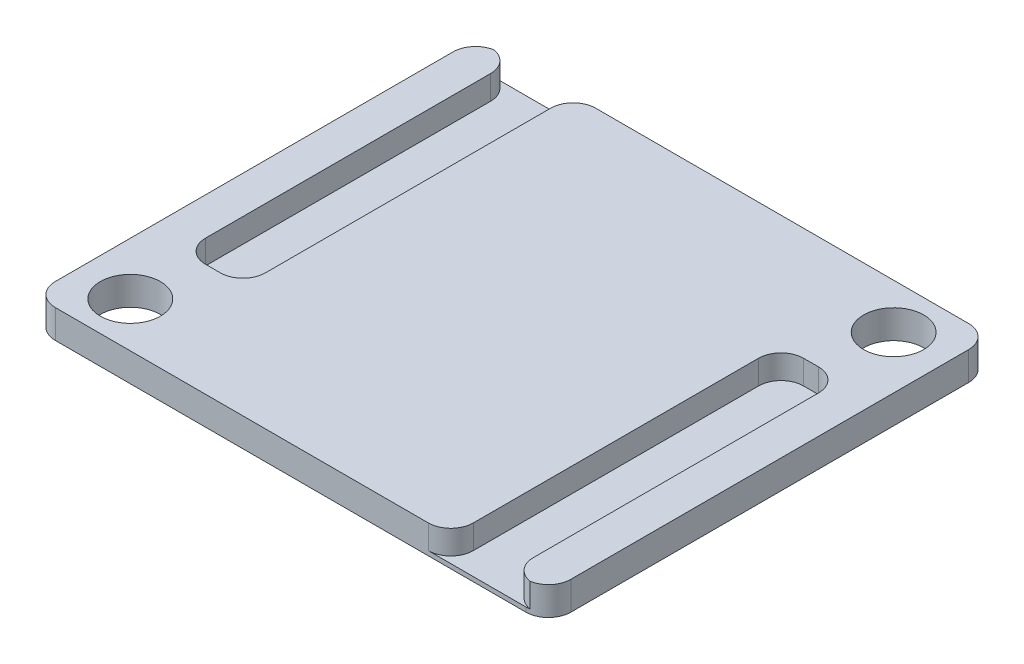
ISO-10303-21;
HEADER;
FILE_DESCRIPTION(('STEP AP214'),'2;1');
FILE_NAME('part.step','',(''),(''),'','','');
FILE_SCHEMA(('AUTOMOTIVE_DESIGN { 1 0 10303 214 1 1 1 1 }'));
ENDSEC;
DATA;
#1=APPLICATION_CONTEXT('core data for automotive mechanical design processes');
#2=APPLICATION_PROTOCOL_DEFINITION('international standard','automotive_design',2000,#1);
#3=PRODUCT_CONTEXT('',#1,'mechanical');
#4=PRODUCT('Part','Part','',(#3));
#5=PRODUCT_RELATED_PRODUCT_CATEGORY('part','',(#4));
#6=PRODUCT_DEFINITION_FORMATION('','',#4);
#7=PRODUCT_DEFINITION_CONTEXT('part definition',#1,'design');
#8=PRODUCT_DEFINITION('design','',#6,#7);
#9=PRODUCT_DEFINITION_SHAPE('','',#8);
#10=(LENGTH_UNIT() NAMED_UNIT(*) SI_UNIT(.MILLI.,.METRE.));
#11=(NAMED_UNIT(*) PLANE_ANGLE_UNIT() SI_UNIT($,.RADIAN.));
#12=(NAMED_UNIT(*) SI_UNIT($,.STERADIAN.) SOLID_ANGLE_UNIT());
#13=UNCERTAINTY_MEASURE_WITH_UNIT(LENGTH_MEASURE(1.E-05),#10,'distance_accuracy_value','');
#14=(GEOMETRIC_REPRESENTATION_CONTEXT(3) GLOBAL_UNCERTAINTY_ASSIGNED_CONTEXT((#13)) GLOBAL_UNIT_ASSIGNED_CONTEXT((#10,
#11,#12)) REPRESENTATION_CONTEXT('',''));
#15=CARTESIAN_POINT('',(0.,0.,0.));
#16=DIRECTION('',(0.,0.,1.));
#17=DIRECTION('',(1.,0.,0.));
#18=AXIS2_PLACEMENT_3D('',#15,#16,#17);
#19=CARTESIAN_POINT('',(0.,1.9,0.));
#20=DIRECTION('',(0.,1.,0.));
#21=DIRECTION('',(0.,0.,1.));
#22=AXIS2_PLACEMENT_3D('',#19,#20,#21);
#23=PLANE('',#22);
#24=DIRECTION('',(-1.,0.,0.));
#25=VECTOR('',#24,1.);
#26=CARTESIAN_POINT('',(0.,1.9,-29.5));
#27=LINE('',#26,#25);
#28=CARTESIAN_POINT('',(32.85,1.9,-29.5));
#29=VERTEX_POINT('',#28);
#30=CARTESIAN_POINT('',(8.,1.9,-29.5));
#31=VERTEX_POINT('',#30);
#32=EDGE_CURVE('E335',#29,#31,#27,.T.);
#33=ORIENTED_EDGE('',*,*,#32,.T.);
#34=CARTESIAN_POINT('',(8.,1.9,-28.));
#35=DIRECTION('',(0.,1.,0.));
#36=DIRECTION('',(0.,0.,1.));
#37=AXIS2_PLACEMENT_3D('',#34,#35,#36);
#38=CIRCLE('',#37,1.5);
#39=CARTESIAN_POINT('',(6.5,1.9,-28.));
#40=VERTEX_POINT('',#39);
#41=EDGE_CURVE('E380',#31,#40,#38,.T.);
#42=ORIENTED_EDGE('',*,*,#41,.T.);
#43=DIRECTION('',(0.,0.,-1.));
#44=VECTOR('',#43,1.);
#45=CARTESIAN_POINT('',(6.5,1.9,-29.5));
#46=LINE('',#45,#44);
#47=CARTESIAN_POINT('',(6.50000000000001,1.9,-9.));
#48=VERTEX_POINT('',#47);
#49=EDGE_CURVE('E268',#48,#40,#46,.T.);
#50=ORIENTED_EDGE('',*,*,#49,.F.);
#51=CARTESIAN_POINT('',(5.00000000000001,1.9,-9.));
#52=DIRECTION('',(0.,1.,0.));
#53=DIRECTION('',(0.,0.,1.));
#54=AXIS2_PLACEMENT_3D('',#51,#52,#53);
#55=CIRCLE('',#54,1.5);
#56=CARTESIAN_POINT('',(5.00000000000001,1.9,-7.5));
#57=VERTEX_POINT('',#56);
#58=EDGE_CURVE('E266',#48,#57,#55,.F.);
#59=ORIENTED_EDGE('',*,*,#58,.T.);
#60=DIRECTION('',(1.,0.,0.));
#61=VECTOR('',#60,1.);
#62=CARTESIAN_POINT('',(2.5,1.9,-7.5));
#63=LINE('',#62,#61);
#64=CARTESIAN_POINT('',(4.,1.9,-7.5));
#65=VERTEX_POINT('',#64);
#66=EDGE_CURVE('E255',#65,#57,#63,.T.);
#67=ORIENTED_EDGE('',*,*,#66,.F.);
#68=CARTESIAN_POINT('',(4.,1.9,-9.));
#69=DIRECTION('',(0.,1.,0.));
#70=DIRECTION('',(0.,0.,1.));
#71=AXIS2_PLACEMENT_3D('',#68,#69,#70);
#72=CIRCLE('',#71,1.5);
#73=CARTESIAN_POINT('',(2.5,1.9,-9.));
#74=VERTEX_POINT('',#73);
#75=EDGE_CURVE('E237',#65,#74,#72,.F.);
#76=ORIENTED_EDGE('',*,*,#75,.T.);
#77=DIRECTION('',(0.,0.,1.));
#78=VECTOR('',#77,1.);
#79=CARTESIAN_POINT('',(2.5,1.9,-29.5));
#80=LINE('',#79,#78);
#81=CARTESIAN_POINT('',(2.5,1.9,-28.));
#82=VERTEX_POINT('',#81);
#83=EDGE_CURVE('E269',#82,#74,#80,.T.);
#84=ORIENTED_EDGE('',*,*,#83,.F.);
#85=CARTESIAN_POINT('',(1.,1.9,-28.));
#86=DIRECTION('',(0.,1.,0.));
#87=DIRECTION('',(0.,0.,1.));
#88=AXIS2_PLACEMENT_3D('',#85,#86,#87);
#89=CIRCLE('',#88,1.5);
#90=CARTESIAN_POINT('',(1.25,1.9,-29.4790199457749));
#91=VERTEX_POINT('',#90);
#92=EDGE_CURVE('E377',#82,#91,#89,.T.);
#93=ORIENTED_EDGE('',*,*,#92,.T.);
#94=CARTESIAN_POINT('',(1.5,1.9,-28.));
#95=DIRECTION('',(0.,1.,0.));
#96=DIRECTION('',(0.,0.,1.));
#97=AXIS2_PLACEMENT_3D('',#94,#95,#96);
#98=CIRCLE('',#97,1.5);
#99=CARTESIAN_POINT('',(0.,1.9,-28.));
#100=VERTEX_POINT('',#99);
#101=EDGE_CURVE('E374',#91,#100,#98,.T.);
#102=ORIENTED_EDGE('',*,*,#101,.T.);
#103=DIRECTION('',(0.,0.,1.));
#104=VECTOR('',#103,1.);
#105=CARTESIAN_POINT('',(0.,1.9,-29.5));
#106=LINE('',#105,#104);
#107=CARTESIAN_POINT('',(0.,1.9,-1.50000000000001));
#108=VERTEX_POINT('',#107);
#109=EDGE_CURVE('E323',#100,#108,#106,.T.);
#110=ORIENTED_EDGE('',*,*,#109,.T.);
#111=CARTESIAN_POINT('',(1.5,1.9,-1.5));
#112=DIRECTION('',(0.,1.,0.));
#113=DIRECTION('',(0.,0.,1.));
#114=AXIS2_PLACEMENT_3D('',#111,#112,#113);
#115=CIRCLE('',#114,1.5);
#116=CARTESIAN_POINT('',(1.5,1.9,0.));
#117=VERTEX_POINT('',#116);
#118=EDGE_CURVE('E372',#108,#117,#115,.T.);
#119=ORIENTED_EDGE('',*,*,#118,.T.);
#120=DIRECTION('',(1.,0.,0.));
#121=VECTOR('',#120,1.);
#122=CARTESIAN_POINT('',(0.,1.9,0.));
#123=LINE('',#122,#121);
#124=CARTESIAN_POINT('',(26.35,1.9,0.));
#125=VERTEX_POINT('',#124);
#126=EDGE_CURVE('E327',#117,#125,#123,.T.);
#127=ORIENTED_EDGE('',*,*,#126,.T.);
#128=CARTESIAN_POINT('',(26.35,1.9,-1.5));
#129=DIRECTION('',(0.,1.,0.));
#130=DIRECTION('',(0.,0.,1.));
#131=AXIS2_PLACEMENT_3D('',#128,#129,#130);
#132=CIRCLE('',#131,1.5);
#133=CARTESIAN_POINT('',(27.85,1.9,-1.5));
#134=VERTEX_POINT('',#133);
#135=EDGE_CURVE('E363',#125,#134,#132,.T.);
#136=ORIENTED_EDGE('',*,*,#135,.T.);
#137=DIRECTION('',(0.,0.,1.));
#138=VECTOR('',#137,1.);
#139=CARTESIAN_POINT('',(27.85,1.9,-22.));
#140=LINE('',#139,#138);
#141=CARTESIAN_POINT('',(27.85,1.9,-20.5));
#142=VERTEX_POINT('',#141);
#143=EDGE_CURVE('E297',#142,#134,#140,.T.);
#144=ORIENTED_EDGE('',*,*,#143,.F.);
#145=CARTESIAN_POINT('',(29.35,1.9,-20.5));
#146=DIRECTION('',(0.,1.,0.));
#147=DIRECTION('',(0.,0.,1.));
#148=AXIS2_PLACEMENT_3D('',#145,#146,#147);
#149=CIRCLE('',#148,1.5);
#150=CARTESIAN_POINT('',(29.35,1.9,-22.));
#151=VERTEX_POINT('',#150);
#152=EDGE_CURVE('E11',#142,#151,#149,.F.);
#153=ORIENTED_EDGE('',*,*,#152,.T.);
#154=DIRECTION('',(-1.,0.,0.));
#155=VECTOR('',#154,1.);
#156=CARTESIAN_POINT('',(27.85,1.9,-22.));
#157=LINE('',#156,#155);
#158=CARTESIAN_POINT('',(30.35,1.9,-22.));
#159=VERTEX_POINT('',#158);
#160=EDGE_CURVE('E286',#159,#151,#157,.T.);
#161=ORIENTED_EDGE('',*,*,#160,.F.);
#162=CARTESIAN_POINT('',(30.35,1.9,-20.5));
#163=DIRECTION('',(0.,1.,0.));
#164=DIRECTION('',(0.,0.,1.));
#165=AXIS2_PLACEMENT_3D('',#162,#163,#164);
#166=CIRCLE('',#165,1.5);
#167=CARTESIAN_POINT('',(31.85,1.9,-20.5));
#168=VERTEX_POINT('',#167);
#169=EDGE_CURVE('E466',#159,#168,#166,.F.);
#170=ORIENTED_EDGE('',*,*,#169,.T.);
#171=DIRECTION('',(0.,0.,-1.));
#172=VECTOR('',#171,1.);
#173=CARTESIAN_POINT('',(31.85,1.9,-22.));
#174=LINE('',#173,#172);
#175=CARTESIAN_POINT('',(31.85,1.9,-1.5));
#176=VERTEX_POINT('',#175);
#177=EDGE_CURVE('E301',#176,#168,#174,.T.);
#178=ORIENTED_EDGE('',*,*,#177,.F.);
#179=CARTESIAN_POINT('',(33.35,1.9,-1.5));
#180=DIRECTION('',(0.,1.,0.));
#181=DIRECTION('',(0.,0.,1.));
#182=AXIS2_PLACEMENT_3D('',#179,#180,#181);
#183=CIRCLE('',#182,1.5);
#184=CARTESIAN_POINT('',(33.1,1.9,-0.0209800542250972));
#185=VERTEX_POINT('',#184);
#186=EDGE_CURVE('E365',#176,#185,#183,.T.);
#187=ORIENTED_EDGE('',*,*,#186,.T.);
#188=CARTESIAN_POINT('',(32.85,1.9,-1.5));
#189=DIRECTION('',(0.,1.,0.));
#190=DIRECTION('',(0.,0.,1.));
#191=AXIS2_PLACEMENT_3D('',#188,#189,#190);
#192=CIRCLE('',#191,1.5);
#193=CARTESIAN_POINT('',(34.35,1.9,-1.5));
#194=VERTEX_POINT('',#193);
#195=EDGE_CURVE('E367',#185,#194,#192,.T.);
#196=ORIENTED_EDGE('',*,*,#195,.T.);
#197=DIRECTION('',(0.,0.,-1.));
#198=VECTOR('',#197,1.);
#199=CARTESIAN_POINT('',(34.35,1.9,0.));
#200=LINE('',#199,#198);
#201=CARTESIAN_POINT('',(34.35,1.9,-28.));
#202=VERTEX_POINT('',#201);
#203=EDGE_CURVE('E331',#194,#202,#200,.T.);
#204=ORIENTED_EDGE('',*,*,#203,.T.);
#205=CARTESIAN_POINT('',(32.85,1.9,-28.));
#206=DIRECTION('',(0.,1.,0.));
#207=DIRECTION('',(0.,0.,1.));
#208=AXIS2_PLACEMENT_3D('',#205,#206,#207);
#209=CIRCLE('',#208,1.5);
#210=EDGE_CURVE('E369',#202,#29,#209,.T.);
#211=ORIENTED_EDGE('',*,*,#210,.T.);
#212=EDGE_LOOP('',(#33,#42,#50,#59,#67,#76,#84,#93,#102,#110,#119,#127,#136,#144,#153,#161,#170,
#178,#187,#196,#204,#211));
#213=FACE_BOUND('',#212,.T.);
#214=CARTESIAN_POINT('',(3.5,1.9,-3.));
#215=DIRECTION('',(0.,1.,0.));
#216=DIRECTION('',(0.,0.,1.));
#217=AXIS2_PLACEMENT_3D('',#214,#215,#216);
#218=CIRCLE('',#217,2.);
#219=CARTESIAN_POINT('',(3.5,1.9,-5.));
#220=VERTEX_POINT('',#219);
#221=EDGE_CURVE('E317',#220,#220,#218,.T.);
#222=ORIENTED_EDGE('',*,*,#221,.F.);
#223=EDGE_LOOP('',(#222));
#224=FACE_BOUND('',#223,.T.);
#225=CARTESIAN_POINT('',(30.85,1.9,-26.5));
#226=DIRECTION('',(0.,1.,0.));
#227=DIRECTION('',(0.,0.,1.));
#228=AXIS2_PLACEMENT_3D('',#225,#226,#227);
#229=CIRCLE('',#228,2.);
#230=CARTESIAN_POINT('',(30.85,1.9,-28.5));
#231=VERTEX_POINT('',#230);
#232=EDGE_CURVE('E309',#231,#231,#229,.T.);
#233=ORIENTED_EDGE('',*,*,#232,.F.);
#234=EDGE_LOOP('',(#233));
#235=FACE_BOUND('',#234,.T.);
#236=ADVANCED_FACE('F42',(#213,#224,#235),#23,.T.);
#237=CARTESIAN_POINT('',(0.,0.,0.));
#238=DIRECTION('',(0.,1.,0.));
#239=DIRECTION('',(0.,0.,1.));
#240=AXIS2_PLACEMENT_3D('',#237,#238,#239);
#241=PLANE('',#240);
#242=CARTESIAN_POINT('',(3.5,0.,-3.));
#243=DIRECTION('',(0.,1.,0.));
#244=DIRECTION('',(0.,0.,1.));
#245=AXIS2_PLACEMENT_3D('',#242,#243,#244);
#246=CIRCLE('',#245,2.);
#247=CARTESIAN_POINT('',(3.5,0.,-5.));
#248=VERTEX_POINT('',#247);
#249=EDGE_CURVE('E313',#248,#248,#246,.T.);
#250=ORIENTED_EDGE('',*,*,#249,.T.);
#251=EDGE_LOOP('',(#250));
#252=FACE_BOUND('',#251,.T.);
#253=DIRECTION('',(0.,0.,1.));
#254=VECTOR('',#253,1.);
#255=CARTESIAN_POINT('',(0.,0.,-29.5));
#256=LINE('',#255,#254);
#257=CARTESIAN_POINT('',(0.,0.,-28.));
#258=VERTEX_POINT('',#257);
#259=CARTESIAN_POINT('',(0.,0.,-1.50000000000001));
#260=VERTEX_POINT('',#259);
#261=EDGE_CURVE('E320',#258,#260,#256,.T.);
#262=ORIENTED_EDGE('',*,*,#261,.F.);
#263=CARTESIAN_POINT('',(1.5,0.,-28.));
#264=DIRECTION('',(0.,1.,0.));
#265=DIRECTION('',(0.,0.,1.));
#266=AXIS2_PLACEMENT_3D('',#263,#264,#265);
#267=CIRCLE('',#266,1.5);
#268=CARTESIAN_POINT('',(1.5,0.,-29.5));
#269=VERTEX_POINT('',#268);
#270=EDGE_CURVE('E414',#258,#269,#267,.F.);
#271=ORIENTED_EDGE('',*,*,#270,.T.);
#272=DIRECTION('',(-1.,0.,0.));
#273=VECTOR('',#272,1.);
#274=CARTESIAN_POINT('',(0.,0.,-29.5));
#275=LINE('',#274,#273);
#276=CARTESIAN_POINT('',(32.85,0.,-29.5));
#277=VERTEX_POINT('',#276);
#278=EDGE_CURVE('E328',#277,#269,#275,.T.);
#279=ORIENTED_EDGE('',*,*,#278,.F.);
#280=CARTESIAN_POINT('',(32.85,0.,-28.));
#281=DIRECTION('',(0.,1.,0.));
#282=DIRECTION('',(0.,0.,1.));
#283=AXIS2_PLACEMENT_3D('',#280,#281,#282);
#284=CIRCLE('',#283,1.5);
#285=CARTESIAN_POINT('',(34.35,0.,-28.));
#286=VERTEX_POINT('',#285);
#287=EDGE_CURVE('E409',#277,#286,#284,.F.);
#288=ORIENTED_EDGE('',*,*,#287,.T.);
#289=DIRECTION('',(0.,0.,-1.));
#290=VECTOR('',#289,1.);
#291=CARTESIAN_POINT('',(34.35,0.,0.));
#292=LINE('',#291,#290);
#293=CARTESIAN_POINT('',(34.35,0.,-1.5));
#294=VERTEX_POINT('',#293);
#295=EDGE_CURVE('E344',#294,#286,#292,.T.);
#296=ORIENTED_EDGE('',*,*,#295,.F.);
#297=CARTESIAN_POINT('',(32.85,0.,-1.5));
#298=DIRECTION('',(0.,1.,0.));
#299=DIRECTION('',(0.,0.,1.));
#300=AXIS2_PLACEMENT_3D('',#297,#298,#299);
#301=CIRCLE('',#300,1.5);
#302=CARTESIAN_POINT('',(32.85,0.,0.));
#303=VERTEX_POINT('',#302);
#304=EDGE_CURVE('E407',#294,#303,#301,.F.);
#305=ORIENTED_EDGE('',*,*,#304,.T.);
#306=DIRECTION('',(1.,0.,0.));
#307=VECTOR('',#306,1.);
#308=CARTESIAN_POINT('',(0.,0.,0.));
#309=LINE('',#308,#307);
#310=CARTESIAN_POINT('',(1.5,0.,0.));
#311=VERTEX_POINT('',#310);
#312=EDGE_CURVE('E341',#311,#303,#309,.T.);
#313=ORIENTED_EDGE('',*,*,#312,.F.);
#314=CARTESIAN_POINT('',(1.5,0.,-1.5));
#315=DIRECTION('',(0.,1.,0.));
#316=DIRECTION('',(0.,0.,1.));
#317=AXIS2_PLACEMENT_3D('',#314,#315,#316);
#318=CIRCLE('',#317,1.5);
#319=EDGE_CURVE('E412',#311,#260,#318,.F.);
#320=ORIENTED_EDGE('',*,*,#319,.T.);
#321=EDGE_LOOP('',(#262,#271,#279,#288,#296,#305,#313,#320));
#322=FACE_BOUND('',#321,.T.);
#323=CARTESIAN_POINT('',(30.85,0.,-26.5));
#324=DIRECTION('',(0.,1.,0.));
#325=DIRECTION('',(0.,0.,1.));
#326=AXIS2_PLACEMENT_3D('',#323,#324,#325);
#327=CIRCLE('',#326,2.);
#328=CARTESIAN_POINT('',(30.85,0.,-28.5));
#329=VERTEX_POINT('',#328);
#330=EDGE_CURVE('E296',#329,#329,#327,.T.);
#331=ORIENTED_EDGE('',*,*,#330,.T.);
#332=EDGE_LOOP('',(#331));
#333=FACE_BOUND('',#332,.T.);
#334=ADVANCED_FACE('F525',(#252,#322,#333),#241,.F.);
#335=CARTESIAN_POINT('',(0.,1.9,-29.5));
#336=DIRECTION('',(1.,0.,0.));
#337=DIRECTION('',(0.,0.,-1.));
#338=AXIS2_PLACEMENT_3D('',#335,#336,#337);
#339=PLANE('',#338);
#340=ORIENTED_EDGE('',*,*,#109,.F.);
#341=DIRECTION('',(0.,-1.,0.));
#342=VECTOR('',#341,1.);
#343=CARTESIAN_POINT('',(0.,1.9,-28.));
#344=LINE('',#343,#342);
#345=EDGE_CURVE('E404',#100,#258,#344,.T.);
#346=ORIENTED_EDGE('',*,*,#345,.T.);
#347=ORIENTED_EDGE('',*,*,#261,.T.);
#348=DIRECTION('',(0.,-1.,0.));
#349=VECTOR('',#348,1.);
#350=CARTESIAN_POINT('',(0.,1.9,-1.5));
#351=LINE('',#350,#349);
#352=EDGE_CURVE('E402',#260,#108,#351,.F.);
#353=ORIENTED_EDGE('',*,*,#352,.T.);
#354=EDGE_LOOP('',(#340,#346,#347,#353));
#355=FACE_BOUND('',#354,.T.);
#356=ADVANCED_FACE('F545',(#355),#339,.F.);
#357=CARTESIAN_POINT('',(0.,1.9,0.));
#358=DIRECTION('',(0.,0.,-1.));
#359=DIRECTION('',(-1.,0.,0.));
#360=AXIS2_PLACEMENT_3D('',#357,#358,#359);
#361=PLANE('',#360);
#362=ORIENTED_EDGE('',*,*,#126,.F.);
#363=DIRECTION('',(0.,-1.,0.));
#364=VECTOR('',#363,1.);
#365=CARTESIAN_POINT('',(1.5,1.9,0.));
#366=LINE('',#365,#364);
#367=EDGE_CURVE('E423',#117,#311,#366,.T.);
#368=ORIENTED_EDGE('',*,*,#367,.T.);
#369=ORIENTED_EDGE('',*,*,#312,.T.);
#370=DIRECTION('',(0.,-1.,0.));
#371=VECTOR('',#370,1.);
#372=CARTESIAN_POINT('',(32.85,1.9,0.));
#373=LINE('',#372,#371);
#374=CARTESIAN_POINT('',(32.85,0.3,0.));
#375=VERTEX_POINT('',#374);
#376=EDGE_CURVE('E420',#303,#375,#373,.F.);
#377=ORIENTED_EDGE('',*,*,#376,.T.);
#378=DIRECTION('',(1.,0.,0.));
#379=VECTOR('',#378,1.);
#380=CARTESIAN_POINT('',(27.85,0.3,0.));
#381=LINE('',#380,#379);
#382=CARTESIAN_POINT('',(26.35,0.3,0.));
#383=VERTEX_POINT('',#382);
#384=EDGE_CURVE('E285',#383,#375,#381,.T.);
#385=ORIENTED_EDGE('',*,*,#384,.F.);
#386=DIRECTION('',(0.,1.,0.));
#387=VECTOR('',#386,1.);
#388=CARTESIAN_POINT('',(26.35,1.9,0.));
#389=LINE('',#388,#387);
#390=EDGE_CURVE('E417',#383,#125,#389,.T.);
#391=ORIENTED_EDGE('',*,*,#390,.T.);
#392=EDGE_LOOP('',(#362,#368,#369,#377,#385,#391));
#393=FACE_BOUND('',#392,.T.);
#394=ADVANCED_FACE('F516',(#393),#361,.F.);
#395=CARTESIAN_POINT('',(34.35,1.9,0.));
#396=DIRECTION('',(-1.,0.,0.));
#397=DIRECTION('',(0.,0.,1.));
#398=AXIS2_PLACEMENT_3D('',#395,#396,#397);
#399=PLANE('',#398);
#400=ORIENTED_EDGE('',*,*,#295,.T.);
#401=DIRECTION('',(0.,-1.,0.));
#402=VECTOR('',#401,1.);
#403=CARTESIAN_POINT('',(34.35,1.9,-28.));
#404=LINE('',#403,#402);
#405=EDGE_CURVE('E429',#286,#202,#404,.F.);
#406=ORIENTED_EDGE('',*,*,#405,.T.);
#407=ORIENTED_EDGE('',*,*,#203,.F.);
#408=DIRECTION('',(0.,-1.,0.));
#409=VECTOR('',#408,1.);
#410=CARTESIAN_POINT('',(34.35,1.9,-1.5));
#411=LINE('',#410,#409);
#412=EDGE_CURVE('E426',#194,#294,#411,.T.);
#413=ORIENTED_EDGE('',*,*,#412,.T.);
#414=EDGE_LOOP('',(#400,#406,#407,#413));
#415=FACE_BOUND('',#414,.T.);
#416=ADVANCED_FACE('F522',(#415),#399,.F.);
#417=CARTESIAN_POINT('',(0.,1.9,-29.5));
#418=DIRECTION('',(0.,0.,1.));
#419=DIRECTION('',(1.,0.,0.));
#420=AXIS2_PLACEMENT_3D('',#417,#418,#419);
#421=PLANE('',#420);
#422=DIRECTION('',(-1.,0.,0.));
#423=VECTOR('',#422,1.);
#424=CARTESIAN_POINT('',(2.5,0.3,-29.5));
#425=LINE('',#424,#423);
#426=CARTESIAN_POINT('',(8.,0.3,-29.5));
#427=VERTEX_POINT('',#426);
#428=CARTESIAN_POINT('',(1.5,0.3,-29.5));
#429=VERTEX_POINT('',#428);
#430=EDGE_CURVE('E302',#427,#429,#425,.T.);
#431=ORIENTED_EDGE('',*,*,#430,.F.);
#432=DIRECTION('',(0.,1.,0.));
#433=VECTOR('',#432,1.);
#434=CARTESIAN_POINT('',(8.,1.9,-29.5));
#435=LINE('',#434,#433);
#436=EDGE_CURVE('E391',#427,#31,#435,.T.);
#437=ORIENTED_EDGE('',*,*,#436,.T.);
#438=ORIENTED_EDGE('',*,*,#32,.F.);
#439=DIRECTION('',(0.,-1.,0.));
#440=VECTOR('',#439,1.);
#441=CARTESIAN_POINT('',(32.85,1.9,-29.5));
#442=LINE('',#441,#440);
#443=EDGE_CURVE('E383',#29,#277,#442,.T.);
#444=ORIENTED_EDGE('',*,*,#443,.T.);
#445=ORIENTED_EDGE('',*,*,#278,.T.);
#446=DIRECTION('',(0.,-1.,0.));
#447=VECTOR('',#446,1.);
#448=CARTESIAN_POINT('',(1.5,1.9,-29.5));
#449=LINE('',#448,#447);
#450=EDGE_CURVE('E387',#269,#429,#449,.F.);
#451=ORIENTED_EDGE('',*,*,#450,.T.);
#452=EDGE_LOOP('',(#431,#437,#438,#444,#445,#451));
#453=FACE_BOUND('',#452,.T.);
#454=ADVANCED_FACE('F534',(#453),#421,.F.);
#455=CARTESIAN_POINT('',(3.5,1.9,-3.));
#456=DIRECTION('',(0.,-1.,0.));
#457=DIRECTION('',(0.,0.,-1.));
#458=AXIS2_PLACEMENT_3D('',#455,#456,#457);
#459=CYLINDRICAL_SURFACE('',#458,2.);
#460=CARTESIAN_POINT('',(3.5,1.9,-5.));
#461=CARTESIAN_POINT('',(3.5,1.88020833333333,-5.));
#462=CARTESIAN_POINT('',(3.5,1.86041666666667,-5.));
#463=CARTESIAN_POINT('',(3.5,1.82083333333333,-5.));
#464=CARTESIAN_POINT('',(3.5,1.80104166666667,-5.));
#465=CARTESIAN_POINT('',(3.5,1.76145833333333,-5.));
#466=CARTESIAN_POINT('',(3.5,1.74166666666667,-5.));
#467=CARTESIAN_POINT('',(3.5,1.70208333333333,-5.));
#468=CARTESIAN_POINT('',(3.5,1.68229166666667,-5.));
#469=CARTESIAN_POINT('',(3.5,1.64270833333333,-5.));
#470=CARTESIAN_POINT('',(3.5,1.62291666666667,-5.));
#471=CARTESIAN_POINT('',(3.5,1.58333333333333,-5.));
#472=CARTESIAN_POINT('',(3.5,1.56354166666667,-5.));
#473=CARTESIAN_POINT('',(3.5,1.52395833333333,-5.));
#474=CARTESIAN_POINT('',(3.5,1.50416666666667,-5.));
#475=CARTESIAN_POINT('',(3.5,1.46458333333333,-5.));
#476=CARTESIAN_POINT('',(3.5,1.44479166666667,-5.));
#477=CARTESIAN_POINT('',(3.5,1.40520833333333,-5.));
#478=CARTESIAN_POINT('',(3.5,1.38541666666667,-5.));
#479=CARTESIAN_POINT('',(3.5,1.34583333333333,-5.));
#480=CARTESIAN_POINT('',(3.5,1.32604166666667,-5.));
#481=CARTESIAN_POINT('',(3.5,1.28645833333333,-5.));
#482=CARTESIAN_POINT('',(3.5,1.26666666666667,-5.));
#483=CARTESIAN_POINT('',(3.5,1.22708333333333,-5.));
#484=CARTESIAN_POINT('',(3.5,1.20729166666667,-5.));
#485=CARTESIAN_POINT('',(3.5,1.16770833333333,-5.));
#486=CARTESIAN_POINT('',(3.5,1.14791666666667,-5.));
#487=CARTESIAN_POINT('',(3.5,1.10833333333333,-5.));
#488=CARTESIAN_POINT('',(3.5,1.08854166666667,-5.));
#489=CARTESIAN_POINT('',(3.5,1.04895833333333,-5.));
#490=CARTESIAN_POINT('',(3.5,1.02916666666667,-5.));
#491=CARTESIAN_POINT('',(3.5,0.989583333333333,-5.));
#492=CARTESIAN_POINT('',(3.5,0.969791666666666,-5.));
#493=CARTESIAN_POINT('',(3.5,0.930208333333333,-5.));
#494=CARTESIAN_POINT('',(3.5,0.910416666666667,-5.));
#495=CARTESIAN_POINT('',(3.5,0.870833333333333,-5.));
#496=CARTESIAN_POINT('',(3.5,0.851041666666667,-5.));
#497=CARTESIAN_POINT('',(3.5,0.811458333333333,-5.));
#498=CARTESIAN_POINT('',(3.5,0.791666666666667,-5.));
#499=CARTESIAN_POINT('',(3.5,0.752083333333333,-5.));
#500=CARTESIAN_POINT('',(3.5,0.732291666666667,-5.));
#501=CARTESIAN_POINT('',(3.5,0.692708333333333,-5.));
#502=CARTESIAN_POINT('',(3.5,0.672916666666667,-5.));
#503=CARTESIAN_POINT('',(3.5,0.633333333333333,-5.));
#504=CARTESIAN_POINT('',(3.5,0.613541666666667,-5.));
#505=CARTESIAN_POINT('',(3.5,0.573958333333333,-5.));
#506=CARTESIAN_POINT('',(3.5,0.554166666666667,-5.));
#507=CARTESIAN_POINT('',(3.5,0.514583333333334,-5.));
#508=CARTESIAN_POINT('',(3.5,0.494791666666667,-5.));
#509=CARTESIAN_POINT('',(3.5,0.455208333333333,-5.));
#510=CARTESIAN_POINT('',(3.5,0.435416666666667,-5.));
#511=CARTESIAN_POINT('',(3.5,0.395833333333333,-5.));
#512=CARTESIAN_POINT('',(3.5,0.376041666666667,-5.));
#513=CARTESIAN_POINT('',(3.5,0.336458333333333,-5.));
#514=CARTESIAN_POINT('',(3.5,0.316666666666667,-5.));
#515=CARTESIAN_POINT('',(3.5,0.277083333333333,-5.));
#516=CARTESIAN_POINT('',(3.5,0.257291666666667,-5.));
#517=CARTESIAN_POINT('',(3.5,0.217708333333333,-5.));
#518=CARTESIAN_POINT('',(3.5,0.197916666666667,-5.));
#519=CARTESIAN_POINT('',(3.5,0.158333333333333,-5.));
#520=CARTESIAN_POINT('',(3.5,0.138541666666667,-5.));
#521=CARTESIAN_POINT('',(3.5,0.0989583333333333,-5.));
#522=CARTESIAN_POINT('',(3.5,0.0791666666666666,-5.));
#523=CARTESIAN_POINT('',(3.5,0.0395833333333333,-5.));
#524=CARTESIAN_POINT('',(3.5,0.0197916666666666,-5.));
#525=CARTESIAN_POINT('',(3.5,0.,-5.));
#526=B_SPLINE_CURVE_WITH_KNOTS('',3,(#460,#461,#462,#463,#464,#465,#466,#467,#468,#469,#470,
#471,#472,#473,#474,#475,#476,#477,#478,#479,#480,#481,#482,#483,#484,#485,#486,#487,#488,#489,
#490,#491,#492,#493,#494,#495,#496,#497,#498,#499,#500,#501,#502,#503,#504,#505,#506,#507,#508,
#509,#510,#511,#512,#513,#514,#515,#516,#517,#518,#519,#520,#521,#522,#523,#524,#525),
.UNSPECIFIED.,.F.,.F.,(4,2,2,2,2,2,2,2,2,2,2,2,2,2,2,2,2,2,2,2,2,2,2,2,2,2,2,2,2,2,2,2,4),(0.,
0.0593750000000002,0.11875,0.178125,0.2375,0.296875,0.35625,0.415625,0.475,0.534375,0.59375,
0.653125,0.7125,0.771875,0.83125,0.890625,0.95,1.009375,1.06875,1.128125,1.1875,1.246875,
1.30625,1.365625,1.425,1.484375,1.54375,1.603125,1.6625,1.721875,1.78125,1.840625,1.9),.UNSPECIFIED.);
#527=EDGE_CURVE('BSEAM594',#220,#248,#526,.T.);
#528=ORIENTED_EDGE('',*,*,#221,.T.);
#529=ORIENTED_EDGE('',*,*,#249,.F.);
#530=ORIENTED_EDGE('',*,*,#527,.T.);
#531=ORIENTED_EDGE('',*,*,#527,.F.);
#532=EDGE_LOOP('',(#528,#530,#529,#531));
#533=FACE_BOUND('',#532,.T.);
#534=ADVANCED_FACE('F594',(#533),#459,.F.);
#535=CARTESIAN_POINT('',(30.85,1.9,-26.5));
#536=DIRECTION('',(0.,-1.,0.));
#537=DIRECTION('',(0.,0.,-1.));
#538=AXIS2_PLACEMENT_3D('',#535,#536,#537);
#539=CYLINDRICAL_SURFACE('',#538,2.);
#540=CARTESIAN_POINT('',(30.85,1.9,-28.5));
#541=CARTESIAN_POINT('',(30.85,1.88020833333333,-28.5));
#542=CARTESIAN_POINT('',(30.85,1.86041666666667,-28.5));
#543=CARTESIAN_POINT('',(30.85,1.82083333333333,-28.5));
#544=CARTESIAN_POINT('',(30.85,1.80104166666667,-28.5));
#545=CARTESIAN_POINT('',(30.85,1.76145833333333,-28.5));
#546=CARTESIAN_POINT('',(30.85,1.74166666666667,-28.5));
#547=CARTESIAN_POINT('',(30.85,1.70208333333333,-28.5));
#548=CARTESIAN_POINT('',(30.85,1.68229166666667,-28.5));
#549=CARTESIAN_POINT('',(30.85,1.64270833333333,-28.5));
#550=CARTESIAN_POINT('',(30.85,1.62291666666667,-28.5));
#551=CARTESIAN_POINT('',(30.85,1.58333333333333,-28.5));
#552=CARTESIAN_POINT('',(30.85,1.56354166666667,-28.5));
#553=CARTESIAN_POINT('',(30.85,1.52395833333333,-28.5));
#554=CARTESIAN_POINT('',(30.85,1.50416666666667,-28.5));
#555=CARTESIAN_POINT('',(30.85,1.46458333333333,-28.5));
#556=CARTESIAN_POINT('',(30.85,1.44479166666667,-28.5));
#557=CARTESIAN_POINT('',(30.85,1.40520833333333,-28.5));
#558=CARTESIAN_POINT('',(30.85,1.38541666666667,-28.5));
#559=CARTESIAN_POINT('',(30.85,1.34583333333333,-28.5));
#560=CARTESIAN_POINT('',(30.85,1.32604166666667,-28.5));
#561=CARTESIAN_POINT('',(30.85,1.28645833333333,-28.5));
#562=CARTESIAN_POINT('',(30.85,1.26666666666667,-28.5));
#563=CARTESIAN_POINT('',(30.85,1.22708333333333,-28.5));
#564=CARTESIAN_POINT('',(30.85,1.20729166666667,-28.5));
#565=CARTESIAN_POINT('',(30.85,1.16770833333333,-28.5));
#566=CARTESIAN_POINT('',(30.85,1.14791666666667,-28.5));
#567=CARTESIAN_POINT('',(30.85,1.10833333333333,-28.5));
#568=CARTESIAN_POINT('',(30.85,1.08854166666667,-28.5));
#569=CARTESIAN_POINT('',(30.85,1.04895833333333,-28.5));
#570=CARTESIAN_POINT('',(30.85,1.02916666666667,-28.5));
#571=CARTESIAN_POINT('',(30.85,0.989583333333333,-28.5));
#572=CARTESIAN_POINT('',(30.85,0.969791666666666,-28.5));
#573=CARTESIAN_POINT('',(30.85,0.930208333333333,-28.5));
#574=CARTESIAN_POINT('',(30.85,0.910416666666667,-28.5));
#575=CARTESIAN_POINT('',(30.85,0.870833333333333,-28.5));
#576=CARTESIAN_POINT('',(30.85,0.851041666666667,-28.5));
#577=CARTESIAN_POINT('',(30.85,0.811458333333333,-28.5));
#578=CARTESIAN_POINT('',(30.85,0.791666666666667,-28.5));
#579=CARTESIAN_POINT('',(30.85,0.752083333333333,-28.5));
#580=CARTESIAN_POINT('',(30.85,0.732291666666667,-28.5));
#581=CARTESIAN_POINT('',(30.85,0.692708333333333,-28.5));
#582=CARTESIAN_POINT('',(30.85,0.672916666666667,-28.5));
#583=CARTESIAN_POINT('',(30.85,0.633333333333333,-28.5));
#584=CARTESIAN_POINT('',(30.85,0.613541666666667,-28.5));
#585=CARTESIAN_POINT('',(30.85,0.573958333333333,-28.5));
#586=CARTESIAN_POINT('',(30.85,0.554166666666667,-28.5));
#587=CARTESIAN_POINT('',(30.85,0.514583333333334,-28.5));
#588=CARTESIAN_POINT('',(30.85,0.494791666666667,-28.5));
#589=CARTESIAN_POINT('',(30.85,0.455208333333333,-28.5));
#590=CARTESIAN_POINT('',(30.85,0.435416666666667,-28.5));
#591=CARTESIAN_POINT('',(30.85,0.395833333333333,-28.5));
#592=CARTESIAN_POINT('',(30.85,0.376041666666667,-28.5));
#593=CARTESIAN_POINT('',(30.85,0.336458333333333,-28.5));
#594=CARTESIAN_POINT('',(30.85,0.316666666666667,-28.5));
#595=CARTESIAN_POINT('',(30.85,0.277083333333333,-28.5));
#596=CARTESIAN_POINT('',(30.85,0.257291666666667,-28.5));
#597=CARTESIAN_POINT('',(30.85,0.217708333333333,-28.5));
#598=CARTESIAN_POINT('',(30.85,0.197916666666667,-28.5));
#599=CARTESIAN_POINT('',(30.85,0.158333333333333,-28.5));
#600=CARTESIAN_POINT('',(30.85,0.138541666666667,-28.5));
#601=CARTESIAN_POINT('',(30.85,0.0989583333333333,-28.5));
#602=CARTESIAN_POINT('',(30.85,0.0791666666666666,-28.5));
#603=CARTESIAN_POINT('',(30.85,0.0395833333333333,-28.5));
#604=CARTESIAN_POINT('',(30.85,0.0197916666666666,-28.5));
#605=CARTESIAN_POINT('',(30.85,0.,-28.5));
#606=B_SPLINE_CURVE_WITH_KNOTS('',3,(#540,#541,#542,#543,#544,#545,#546,#547,#548,#549,#550,
#551,#552,#553,#554,#555,#556,#557,#558,#559,#560,#561,#562,#563,#564,#565,#566,#567,#568,#569,
#570,#571,#572,#573,#574,#575,#576,#577,#578,#579,#580,#581,#582,#583,#584,#585,#586,#587,#588,
#589,#590,#591,#592,#593,#594,#595,#596,#597,#598,#599,#600,#601,#602,#603,#604,#605),
.UNSPECIFIED.,.F.,.F.,(4,2,2,2,2,2,2,2,2,2,2,2,2,2,2,2,2,2,2,2,2,2,2,2,2,2,2,2,2,2,2,2,4),(0.,
0.0593750000000002,0.11875,0.178125,0.2375,0.296875,0.35625,0.415625,0.475,0.534375,0.59375,
0.653125,0.7125,0.771875,0.83125,0.890625,0.95,1.009375,1.06875,1.128125,1.1875,1.246875,
1.30625,1.365625,1.425,1.484375,1.54375,1.603125,1.6625,1.721875,1.78125,1.840625,1.9),.UNSPECIFIED.);
#607=EDGE_CURVE('BSEAM625',#231,#329,#606,.T.);
#608=ORIENTED_EDGE('',*,*,#232,.T.);
#609=ORIENTED_EDGE('',*,*,#330,.F.);
#610=ORIENTED_EDGE('',*,*,#607,.T.);
#611=ORIENTED_EDGE('',*,*,#607,.F.);
#612=EDGE_LOOP('',(#608,#610,#609,#611));
#613=FACE_BOUND('',#612,.T.);
#614=ADVANCED_FACE('F625',(#613),#539,.F.);
#615=CARTESIAN_POINT('',(27.85,0.3,-22.));
#616=DIRECTION('',(-1.,0.,0.));
#617=DIRECTION('',(0.,0.,1.));
#618=AXIS2_PLACEMENT_3D('',#615,#616,#617);
#619=PLANE('',#618);
#620=ORIENTED_EDGE('',*,*,#143,.T.);
#621=DIRECTION('',(0.,1.,0.));
#622=VECTOR('',#621,1.);
#623=CARTESIAN_POINT('',(27.85,0.3,-1.5));
#624=LINE('',#623,#622);
#625=CARTESIAN_POINT('',(27.85,0.3,-1.5));
#626=VERTEX_POINT('',#625);
#627=EDGE_CURVE('E249',#134,#626,#624,.F.);
#628=ORIENTED_EDGE('',*,*,#627,.T.);
#629=DIRECTION('',(0.,0.,1.));
#630=VECTOR('',#629,1.);
#631=CARTESIAN_POINT('',(27.85,0.3,-22.));
#632=LINE('',#631,#630);
#633=CARTESIAN_POINT('',(27.85,0.3,-20.5));
#634=VERTEX_POINT('',#633);
#635=EDGE_CURVE('E281',#634,#626,#632,.T.);
#636=ORIENTED_EDGE('',*,*,#635,.F.);
#637=DIRECTION('',(0.,1.,0.));
#638=VECTOR('',#637,1.);
#639=CARTESIAN_POINT('',(27.85,1.9,-20.5));
#640=LINE('',#639,#638);
#641=EDGE_CURVE('E450',#634,#142,#640,.T.);
#642=ORIENTED_EDGE('',*,*,#641,.T.);
#643=EDGE_LOOP('',(#620,#628,#636,#642));
#644=FACE_BOUND('',#643,.T.);
#645=ADVANCED_FACE('F508',(#644),#619,.F.);
#646=CARTESIAN_POINT('',(27.85,0.3,-22.));
#647=DIRECTION('',(0.,0.,-1.));
#648=DIRECTION('',(-1.,0.,0.));
#649=AXIS2_PLACEMENT_3D('',#646,#647,#648);
#650=PLANE('',#649);
#651=DIRECTION('',(-1.,0.,0.));
#652=VECTOR('',#651,1.);
#653=CARTESIAN_POINT('',(27.85,0.3,-22.));
#654=LINE('',#653,#652);
#655=CARTESIAN_POINT('',(30.35,0.3,-22.));
#656=VERTEX_POINT('',#655);
#657=CARTESIAN_POINT('',(29.35,0.3,-22.));
#658=VERTEX_POINT('',#657);
#659=EDGE_CURVE('E292',#656,#658,#654,.T.);
#660=ORIENTED_EDGE('',*,*,#659,.F.);
#661=DIRECTION('',(0.,1.,0.));
#662=VECTOR('',#661,1.);
#663=CARTESIAN_POINT('',(30.35,1.9,-22.));
#664=LINE('',#663,#662);
#665=EDGE_CURVE('E435',#656,#159,#664,.T.);
#666=ORIENTED_EDGE('',*,*,#665,.T.);
#667=ORIENTED_EDGE('',*,*,#160,.T.);
#668=DIRECTION('',(0.,1.,0.));
#669=VECTOR('',#668,1.);
#670=CARTESIAN_POINT('',(29.35,0.3,-22.));
#671=LINE('',#670,#669);
#672=EDGE_CURVE('E432',#151,#658,#671,.F.);
#673=ORIENTED_EDGE('',*,*,#672,.T.);
#674=EDGE_LOOP('',(#660,#666,#667,#673));
#675=FACE_BOUND('',#674,.T.);
#676=ADVANCED_FACE('F500',(#675),#650,.F.);
#677=CARTESIAN_POINT('',(31.85,0.3,-22.));
#678=DIRECTION('',(1.,0.,0.));
#679=DIRECTION('',(0.,0.,-1.));
#680=AXIS2_PLACEMENT_3D('',#677,#678,#679);
#681=PLANE('',#680);
#682=ORIENTED_EDGE('',*,*,#177,.T.);
#683=DIRECTION('',(0.,1.,0.));
#684=VECTOR('',#683,1.);
#685=CARTESIAN_POINT('',(31.85,0.3,-20.5));
#686=LINE('',#685,#684);
#687=CARTESIAN_POINT('',(31.85,0.3,-20.5));
#688=VERTEX_POINT('',#687);
#689=EDGE_CURVE('E441',#168,#688,#686,.F.);
#690=ORIENTED_EDGE('',*,*,#689,.T.);
#691=DIRECTION('',(0.,0.,-1.));
#692=VECTOR('',#691,1.);
#693=CARTESIAN_POINT('',(31.85,0.3,-22.));
#694=LINE('',#693,#692);
#695=CARTESIAN_POINT('',(31.85,0.3,-1.5));
#696=VERTEX_POINT('',#695);
#697=EDGE_CURVE('E288',#696,#688,#694,.T.);
#698=ORIENTED_EDGE('',*,*,#697,.F.);
#699=DIRECTION('',(0.,1.,0.));
#700=VECTOR('',#699,1.);
#701=CARTESIAN_POINT('',(31.85,0.3,-1.5));
#702=LINE('',#701,#700);
#703=EDGE_CURVE('E439',#696,#176,#702,.T.);
#704=ORIENTED_EDGE('',*,*,#703,.T.);
#705=EDGE_LOOP('',(#682,#690,#698,#704));
#706=FACE_BOUND('',#705,.T.);
#707=ADVANCED_FACE('F491',(#706),#681,.F.);
#708=CARTESIAN_POINT('',(0.,0.3,0.));
#709=DIRECTION('',(0.,1.,0.));
#710=DIRECTION('',(0.,0.,1.));
#711=AXIS2_PLACEMENT_3D('',#708,#709,#710);
#712=PLANE('',#711);
#713=ORIENTED_EDGE('',*,*,#697,.T.);
#714=CARTESIAN_POINT('',(30.35,0.3,-20.5));
#715=DIRECTION('',(0.,1.,0.));
#716=DIRECTION('',(0.,0.,1.));
#717=AXIS2_PLACEMENT_3D('',#714,#715,#716);
#718=CIRCLE('',#717,1.5);
#719=EDGE_CURVE('E447',#688,#656,#718,.T.);
#720=ORIENTED_EDGE('',*,*,#719,.T.);
#721=ORIENTED_EDGE('',*,*,#659,.T.);
#722=CARTESIAN_POINT('',(29.35,0.3,-20.5));
#723=DIRECTION('',(0.,1.,0.));
#724=DIRECTION('',(0.,0.,1.));
#725=AXIS2_PLACEMENT_3D('',#722,#723,#724);
#726=CIRCLE('',#725,1.5);
#727=EDGE_CURVE('E444',#658,#634,#726,.T.);
#728=ORIENTED_EDGE('',*,*,#727,.T.);
#729=ORIENTED_EDGE('',*,*,#635,.T.);
#730=CARTESIAN_POINT('',(26.35,0.3,-1.5));
#731=DIRECTION('',(0.,1.,0.));
#732=DIRECTION('',(0.,0.,1.));
#733=AXIS2_PLACEMENT_3D('',#730,#731,#732);
#734=CIRCLE('',#733,1.5);
#735=EDGE_CURVE('E52',#626,#383,#734,.F.);
#736=ORIENTED_EDGE('',*,*,#735,.T.);
#737=ORIENTED_EDGE('',*,*,#384,.T.);
#738=CARTESIAN_POINT('',(32.85,0.3,-1.5));
#739=DIRECTION('',(0.,1.,0.));
#740=DIRECTION('',(0.,0.,1.));
#741=AXIS2_PLACEMENT_3D('',#738,#739,#740);
#742=CIRCLE('',#741,1.5);
#743=CARTESIAN_POINT('',(33.1,0.3,-0.0209800542250965));
#744=VERTEX_POINT('',#743);
#745=EDGE_CURVE('E60',#375,#744,#742,.T.);
#746=ORIENTED_EDGE('',*,*,#745,.T.);
#747=CARTESIAN_POINT('',(33.35,0.3,-1.5));
#748=DIRECTION('',(0.,1.,0.));
#749=DIRECTION('',(0.,0.,1.));
#750=AXIS2_PLACEMENT_3D('',#747,#748,#749);
#751=CIRCLE('',#750,1.5);
#752=EDGE_CURVE('E469',#744,#696,#751,.F.);
#753=ORIENTED_EDGE('',*,*,#752,.T.);
#754=EDGE_LOOP('',(#713,#720,#721,#728,#729,#736,#737,#746,#753));
#755=FACE_BOUND('',#754,.T.);
#756=ADVANCED_FACE('F488',(#755),#712,.T.);
#757=CARTESIAN_POINT('',(2.5,0.3,-29.5));
#758=DIRECTION('',(-1.,0.,0.));
#759=DIRECTION('',(0.,0.,1.));
#760=AXIS2_PLACEMENT_3D('',#757,#758,#759);
#761=PLANE('',#760);
#762=ORIENTED_EDGE('',*,*,#83,.T.);
#763=DIRECTION('',(0.,1.,0.));
#764=VECTOR('',#763,1.);
#765=CARTESIAN_POINT('',(2.5,0.3,-9.));
#766=LINE('',#765,#764);
#767=CARTESIAN_POINT('',(2.5,0.3,-9.));
#768=VERTEX_POINT('',#767);
#769=EDGE_CURVE('E242',#74,#768,#766,.F.);
#770=ORIENTED_EDGE('',*,*,#769,.T.);
#771=DIRECTION('',(0.,0.,1.));
#772=VECTOR('',#771,1.);
#773=CARTESIAN_POINT('',(2.5,0.3,-29.5));
#774=LINE('',#773,#772);
#775=CARTESIAN_POINT('',(2.5,0.3,-28.));
#776=VERTEX_POINT('',#775);
#777=EDGE_CURVE('E274',#776,#768,#774,.T.);
#778=ORIENTED_EDGE('',*,*,#777,.F.);
#779=DIRECTION('',(0.,1.,0.));
#780=VECTOR('',#779,1.);
#781=CARTESIAN_POINT('',(2.5,0.3,-28.));
#782=LINE('',#781,#780);
#783=EDGE_CURVE('E260',#776,#82,#782,.T.);
#784=ORIENTED_EDGE('',*,*,#783,.T.);
#785=EDGE_LOOP('',(#762,#770,#778,#784));
#786=FACE_BOUND('',#785,.T.);
#787=ADVANCED_FACE('F575',(#786),#761,.F.);
#788=CARTESIAN_POINT('',(6.5,0.3,-29.5));
#789=DIRECTION('',(1.,0.,0.));
#790=DIRECTION('',(0.,0.,-1.));
#791=AXIS2_PLACEMENT_3D('',#788,#789,#790);
#792=PLANE('',#791);
#793=ORIENTED_EDGE('',*,*,#49,.T.);
#794=DIRECTION('',(0.,1.,0.));
#795=VECTOR('',#794,1.);
#796=CARTESIAN_POINT('',(6.5,0.3,-28.));
#797=LINE('',#796,#795);
#798=CARTESIAN_POINT('',(6.5,0.3,-28.));
#799=VERTEX_POINT('',#798);
#800=EDGE_CURVE('E399',#40,#799,#797,.F.);
#801=ORIENTED_EDGE('',*,*,#800,.T.);
#802=DIRECTION('',(0.,0.,-1.));
#803=VECTOR('',#802,1.);
#804=CARTESIAN_POINT('',(6.5,0.3,-29.5));
#805=LINE('',#804,#803);
#806=CARTESIAN_POINT('',(6.50000000000001,0.3,-9.));
#807=VERTEX_POINT('',#806);
#808=EDGE_CURVE('E551',#807,#799,#805,.T.);
#809=ORIENTED_EDGE('',*,*,#808,.F.);
#810=DIRECTION('',(0.,1.,0.));
#811=VECTOR('',#810,1.);
#812=CARTESIAN_POINT('',(6.50000000000001,1.9,-9.));
#813=LINE('',#812,#811);
#814=EDGE_CURVE('E395',#807,#48,#813,.T.);
#815=ORIENTED_EDGE('',*,*,#814,.T.);
#816=EDGE_LOOP('',(#793,#801,#809,#815));
#817=FACE_BOUND('',#816,.T.);
#818=ADVANCED_FACE('F561',(#817),#792,.F.);
#819=CARTESIAN_POINT('',(2.5,0.3,-7.5));
#820=DIRECTION('',(0.,0.,1.));
#821=DIRECTION('',(1.,0.,0.));
#822=AXIS2_PLACEMENT_3D('',#819,#820,#821);
#823=PLANE('',#822);
#824=DIRECTION('',(1.,0.,0.));
#825=VECTOR('',#824,1.);
#826=CARTESIAN_POINT('',(2.5,0.3,-7.5));
#827=LINE('',#826,#825);
#828=CARTESIAN_POINT('',(4.,0.3,-7.5));
#829=VERTEX_POINT('',#828);
#830=CARTESIAN_POINT('',(5.00000000000001,0.3,-7.5));
#831=VERTEX_POINT('',#830);
#832=EDGE_CURVE('E258',#829,#831,#827,.T.);
#833=ORIENTED_EDGE('',*,*,#832,.F.);
#834=DIRECTION('',(0.,1.,0.));
#835=VECTOR('',#834,1.);
#836=CARTESIAN_POINT('',(4.,1.9,-7.5));
#837=LINE('',#836,#835);
#838=EDGE_CURVE('E241',#829,#65,#837,.T.);
#839=ORIENTED_EDGE('',*,*,#838,.T.);
#840=ORIENTED_EDGE('',*,*,#66,.T.);
#841=DIRECTION('',(0.,1.,0.));
#842=VECTOR('',#841,1.);
#843=CARTESIAN_POINT('',(5.00000000000001,0.3,-7.5));
#844=LINE('',#843,#842);
#845=EDGE_CURVE('E261',#57,#831,#844,.F.);
#846=ORIENTED_EDGE('',*,*,#845,.T.);
#847=EDGE_LOOP('',(#833,#839,#840,#846));
#848=FACE_BOUND('',#847,.T.);
#849=ADVANCED_FACE('F254',(#848),#823,.F.);
#850=CARTESIAN_POINT('',(0.,0.3,0.));
#851=DIRECTION('',(0.,1.,0.));
#852=DIRECTION('',(0.,0.,1.));
#853=AXIS2_PLACEMENT_3D('',#850,#851,#852);
#854=PLANE('',#853);
#855=ORIENTED_EDGE('',*,*,#777,.T.);
#856=CARTESIAN_POINT('',(4.,0.3,-9.));
#857=DIRECTION('',(0.,1.,0.));
#858=DIRECTION('',(0.,0.,1.));
#859=AXIS2_PLACEMENT_3D('',#856,#857,#858);
#860=CIRCLE('',#859,1.5);
#861=EDGE_CURVE('E360',#768,#829,#860,.T.);
#862=ORIENTED_EDGE('',*,*,#861,.T.);
#863=ORIENTED_EDGE('',*,*,#832,.T.);
#864=CARTESIAN_POINT('',(5.00000000000001,0.3,-9.));
#865=DIRECTION('',(0.,1.,0.));
#866=DIRECTION('',(0.,0.,1.));
#867=AXIS2_PLACEMENT_3D('',#864,#865,#866);
#868=CIRCLE('',#867,1.5);
#869=EDGE_CURVE('E358',#831,#807,#868,.T.);
#870=ORIENTED_EDGE('',*,*,#869,.T.);
#871=ORIENTED_EDGE('',*,*,#808,.T.);
#872=CARTESIAN_POINT('',(8.,0.3,-28.));
#873=DIRECTION('',(0.,1.,0.));
#874=DIRECTION('',(0.,0.,1.));
#875=AXIS2_PLACEMENT_3D('',#872,#873,#874);
#876=CIRCLE('',#875,1.5);
#877=EDGE_CURVE('E457',#799,#427,#876,.F.);
#878=ORIENTED_EDGE('',*,*,#877,.T.);
#879=ORIENTED_EDGE('',*,*,#430,.T.);
#880=CARTESIAN_POINT('',(1.5,0.3,-28.));
#881=DIRECTION('',(0.,1.,0.));
#882=DIRECTION('',(0.,0.,1.));
#883=AXIS2_PLACEMENT_3D('',#880,#881,#882);
#884=CIRCLE('',#883,1.5);
#885=CARTESIAN_POINT('',(1.25,0.3,-29.4790199457749));
#886=VERTEX_POINT('',#885);
#887=EDGE_CURVE('E71',#429,#886,#884,.T.);
#888=ORIENTED_EDGE('',*,*,#887,.T.);
#889=CARTESIAN_POINT('',(1.,0.3,-28.));
#890=DIRECTION('',(0.,1.,0.));
#891=DIRECTION('',(0.,0.,1.));
#892=AXIS2_PLACEMENT_3D('',#889,#890,#891);
#893=CIRCLE('',#892,1.5);
#894=EDGE_CURVE('E248',#886,#776,#893,.F.);
#895=ORIENTED_EDGE('',*,*,#894,.T.);
#896=EDGE_LOOP('',(#855,#862,#863,#870,#871,#878,#879,#888,#895));
#897=FACE_BOUND('',#896,.T.);
#898=ADVANCED_FACE('F555',(#897),#854,.T.);
#899=CARTESIAN_POINT('',(4.,0.3,-9.));
#900=DIRECTION('',(0.,-1.,0.));
#901=DIRECTION('',(0.,0.,-1.));
#902=AXIS2_PLACEMENT_3D('',#899,#900,#901);
#903=CYLINDRICAL_SURFACE('',#902,1.5);
#904=ORIENTED_EDGE('',*,*,#861,.F.);
#905=ORIENTED_EDGE('',*,*,#769,.F.);
#906=ORIENTED_EDGE('',*,*,#75,.F.);
#907=ORIENTED_EDGE('',*,*,#838,.F.);
#908=EDGE_LOOP('',(#904,#905,#906,#907));
#909=FACE_BOUND('',#908,.T.);
#910=ADVANCED_FACE('F240',(#909),#903,.F.);
#911=CARTESIAN_POINT('',(1.5,1.9,-28.));
#912=DIRECTION('',(0.,-1.,0.));
#913=DIRECTION('',(0.,0.,-1.));
#914=AXIS2_PLACEMENT_3D('',#911,#912,#913);
#915=CYLINDRICAL_SURFACE('',#914,1.5);
#916=DIRECTION('',(0.,-1.,0.));
#917=VECTOR('',#916,1.);
#918=CARTESIAN_POINT('',(1.25,0.3,-29.4790199457749));
#919=LINE('',#918,#917);
#920=EDGE_CURVE('E277',#886,#91,#919,.F.);
#921=ORIENTED_EDGE('',*,*,#920,.F.);
#922=ORIENTED_EDGE('',*,*,#887,.F.);
#923=ORIENTED_EDGE('',*,*,#450,.F.);
#924=ORIENTED_EDGE('',*,*,#270,.F.);
#925=ORIENTED_EDGE('',*,*,#345,.F.);
#926=ORIENTED_EDGE('',*,*,#101,.F.);
#927=EDGE_LOOP('',(#921,#922,#923,#924,#925,#926));
#928=FACE_BOUND('',#927,.T.);
#929=ADVANCED_FACE('F549',(#928),#915,.T.);
#930=CARTESIAN_POINT('',(1.,0.3,-28.));
#931=DIRECTION('',(0.,1.,0.));
#932=DIRECTION('',(0.,0.,1.));
#933=AXIS2_PLACEMENT_3D('',#930,#931,#932);
#934=CYLINDRICAL_SURFACE('',#933,1.5);
#935=ORIENTED_EDGE('',*,*,#894,.F.);
#936=ORIENTED_EDGE('',*,*,#920,.T.);
#937=ORIENTED_EDGE('',*,*,#92,.F.);
#938=ORIENTED_EDGE('',*,*,#783,.F.);
#939=EDGE_LOOP('',(#935,#936,#937,#938));
#940=FACE_BOUND('',#939,.T.);
#941=ADVANCED_FACE('F576',(#940),#934,.T.);
#942=CARTESIAN_POINT('',(8.,1.9,-28.));
#943=DIRECTION('',(0.,1.,0.));
#944=DIRECTION('',(0.,0.,1.));
#945=AXIS2_PLACEMENT_3D('',#942,#943,#944);
#946=CYLINDRICAL_SURFACE('',#945,1.5);
#947=ORIENTED_EDGE('',*,*,#877,.F.);
#948=ORIENTED_EDGE('',*,*,#800,.F.);
#949=ORIENTED_EDGE('',*,*,#41,.F.);
#950=ORIENTED_EDGE('',*,*,#436,.F.);
#951=EDGE_LOOP('',(#947,#948,#949,#950));
#952=FACE_BOUND('',#951,.T.);
#953=ADVANCED_FACE('F559',(#952),#946,.T.);
#954=CARTESIAN_POINT('',(5.00000000000001,0.3,-9.));
#955=DIRECTION('',(0.,-1.,0.));
#956=DIRECTION('',(0.,0.,-1.));
#957=AXIS2_PLACEMENT_3D('',#954,#955,#956);
#958=CYLINDRICAL_SURFACE('',#957,1.5);
#959=ORIENTED_EDGE('',*,*,#869,.F.);
#960=ORIENTED_EDGE('',*,*,#845,.F.);
#961=ORIENTED_EDGE('',*,*,#58,.F.);
#962=ORIENTED_EDGE('',*,*,#814,.F.);
#963=EDGE_LOOP('',(#959,#960,#961,#962));
#964=FACE_BOUND('',#963,.T.);
#965=ADVANCED_FACE('F565',(#964),#958,.F.);
#966=CARTESIAN_POINT('',(1.5,1.9,-1.5));
#967=DIRECTION('',(0.,-1.,0.));
#968=DIRECTION('',(0.,0.,-1.));
#969=AXIS2_PLACEMENT_3D('',#966,#967,#968);
#970=CYLINDRICAL_SURFACE('',#969,1.5);
#971=ORIENTED_EDGE('',*,*,#118,.F.);
#972=ORIENTED_EDGE('',*,*,#352,.F.);
#973=ORIENTED_EDGE('',*,*,#319,.F.);
#974=ORIENTED_EDGE('',*,*,#367,.F.);
#975=EDGE_LOOP('',(#971,#972,#973,#974));
#976=FACE_BOUND('',#975,.T.);
#977=ADVANCED_FACE('F540',(#976),#970,.T.);
#978=CARTESIAN_POINT('',(32.85,1.9,-28.));
#979=DIRECTION('',(0.,-1.,0.));
#980=DIRECTION('',(0.,0.,-1.));
#981=AXIS2_PLACEMENT_3D('',#978,#979,#980);
#982=CYLINDRICAL_SURFACE('',#981,1.5);
#983=ORIENTED_EDGE('',*,*,#210,.F.);
#984=ORIENTED_EDGE('',*,*,#405,.F.);
#985=ORIENTED_EDGE('',*,*,#287,.F.);
#986=ORIENTED_EDGE('',*,*,#443,.F.);
#987=EDGE_LOOP('',(#983,#984,#985,#986));
#988=FACE_BOUND('',#987,.T.);
#989=ADVANCED_FACE('F531',(#988),#982,.T.);
#990=CARTESIAN_POINT('',(33.35,0.3,-1.5));
#991=DIRECTION('',(0.,1.,0.));
#992=DIRECTION('',(0.,0.,1.));
#993=AXIS2_PLACEMENT_3D('',#990,#991,#992);
#994=CYLINDRICAL_SURFACE('',#993,1.5);
#995=ORIENTED_EDGE('',*,*,#703,.F.);
#996=ORIENTED_EDGE('',*,*,#752,.F.);
#997=DIRECTION('',(0.,1.,0.));
#998=VECTOR('',#997,1.);
#999=CARTESIAN_POINT('',(33.1,1.1,-0.0209800542250965));
#1000=LINE('',#999,#998);
#1001=EDGE_CURVE('E46',#185,#744,#1000,.F.);
#1002=ORIENTED_EDGE('',*,*,#1001,.F.);
#1003=ORIENTED_EDGE('',*,*,#186,.F.);
#1004=EDGE_LOOP('',(#995,#996,#1002,#1003));
#1005=FACE_BOUND('',#1004,.T.);
#1006=ADVANCED_FACE('F486',(#1005),#994,.T.);
#1007=CARTESIAN_POINT('',(32.85,1.9,-1.5));
#1008=DIRECTION('',(0.,-1.,0.));
#1009=DIRECTION('',(0.,0.,-1.));
#1010=AXIS2_PLACEMENT_3D('',#1007,#1008,#1009);
#1011=CYLINDRICAL_SURFACE('',#1010,1.5);
#1012=ORIENTED_EDGE('',*,*,#745,.F.);
#1013=ORIENTED_EDGE('',*,*,#376,.F.);
#1014=ORIENTED_EDGE('',*,*,#304,.F.);
#1015=ORIENTED_EDGE('',*,*,#412,.F.);
#1016=ORIENTED_EDGE('',*,*,#195,.F.);
#1017=ORIENTED_EDGE('',*,*,#1001,.T.);
#1018=EDGE_LOOP('',(#1012,#1013,#1014,#1015,#1016,#1017));
#1019=FACE_BOUND('',#1018,.T.);
#1020=ADVANCED_FACE('F480',(#1019),#1011,.T.);
#1021=CARTESIAN_POINT('',(30.35,0.3,-20.5));
#1022=DIRECTION('',(0.,-1.,0.));
#1023=DIRECTION('',(0.,0.,-1.));
#1024=AXIS2_PLACEMENT_3D('',#1021,#1022,#1023);
#1025=CYLINDRICAL_SURFACE('',#1024,1.5);
#1026=ORIENTED_EDGE('',*,*,#719,.F.);
#1027=ORIENTED_EDGE('',*,*,#689,.F.);
#1028=ORIENTED_EDGE('',*,*,#169,.F.);
#1029=ORIENTED_EDGE('',*,*,#665,.F.);
#1030=EDGE_LOOP('',(#1026,#1027,#1028,#1029));
#1031=FACE_BOUND('',#1030,.T.);
#1032=ADVANCED_FACE('F495',(#1031),#1025,.F.);
#1033=CARTESIAN_POINT('',(26.35,1.9,-1.5));
#1034=DIRECTION('',(0.,1.,0.));
#1035=DIRECTION('',(0.,0.,1.));
#1036=AXIS2_PLACEMENT_3D('',#1033,#1034,#1035);
#1037=CYLINDRICAL_SURFACE('',#1036,1.5);
#1038=ORIENTED_EDGE('',*,*,#735,.F.);
#1039=ORIENTED_EDGE('',*,*,#627,.F.);
#1040=ORIENTED_EDGE('',*,*,#135,.F.);
#1041=ORIENTED_EDGE('',*,*,#390,.F.);
#1042=EDGE_LOOP('',(#1038,#1039,#1040,#1041));
#1043=FACE_BOUND('',#1042,.T.);
#1044=ADVANCED_FACE('F512',(#1043),#1037,.T.);
#1045=CARTESIAN_POINT('',(29.35,0.3,-20.5));
#1046=DIRECTION('',(0.,-1.,0.));
#1047=DIRECTION('',(0.,0.,-1.));
#1048=AXIS2_PLACEMENT_3D('',#1045,#1046,#1047);
#1049=CYLINDRICAL_SURFACE('',#1048,1.5);
#1050=ORIENTED_EDGE('',*,*,#727,.F.);
#1051=ORIENTED_EDGE('',*,*,#672,.F.);
#1052=ORIENTED_EDGE('',*,*,#152,.F.);
#1053=ORIENTED_EDGE('',*,*,#641,.F.);
#1054=EDGE_LOOP('',(#1050,#1051,#1052,#1053));
#1055=FACE_BOUND('',#1054,.T.);
#1056=ADVANCED_FACE('F44',(#1055),#1049,.F.);
#1057=CLOSED_SHELL('',(#236,#334,#356,#394,#416,#454,#534,#614,#645,#676,#707,#756,#787,#818,
#849,#898,#910,#929,#941,#953,#965,#977,#989,#1006,#1020,#1032,#1044,#1056));
#1058=MANIFOLD_SOLID_BREP('B2',#1057);
#1059=ADVANCED_BREP_SHAPE_REPRESENTATION('',(#18,#1058),#14);
#1060=SHAPE_DEFINITION_REPRESENTATION(#9,#1059);
ENDSEC;
END-ISO-10303-21;
